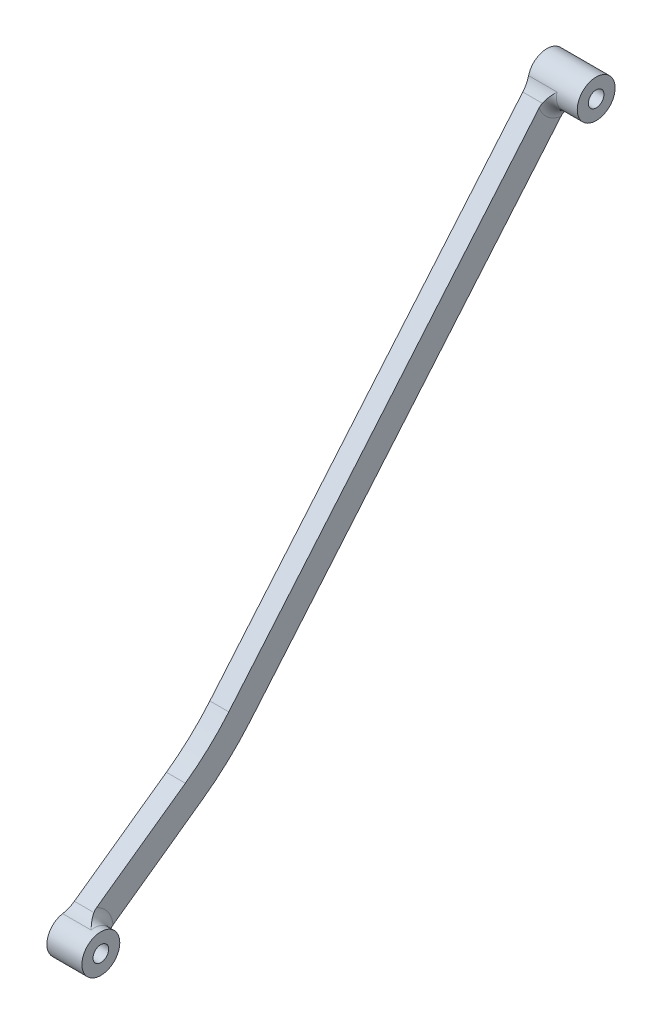
ISO-10303-21;
HEADER;
FILE_DESCRIPTION(('STEP AP214'),'2;1');
FILE_NAME('part.step','',(''),(''),'','','');
FILE_SCHEMA(('AUTOMOTIVE_DESIGN { 1 0 10303 214 1 1 1 1 }'));
ENDSEC;
DATA;
#1=APPLICATION_CONTEXT('core data for automotive mechanical design processes');
#2=APPLICATION_PROTOCOL_DEFINITION('international standard','automotive_design',2000,#1);
#3=PRODUCT_CONTEXT('',#1,'mechanical');
#4=PRODUCT('Part','Part','',(#3));
#5=PRODUCT_RELATED_PRODUCT_CATEGORY('part','',(#4));
#6=PRODUCT_DEFINITION_FORMATION('','',#4);
#7=PRODUCT_DEFINITION_CONTEXT('part definition',#1,'design');
#8=PRODUCT_DEFINITION('design','',#6,#7);
#9=PRODUCT_DEFINITION_SHAPE('','',#8);
#10=(LENGTH_UNIT() NAMED_UNIT(*) SI_UNIT(.MILLI.,.METRE.));
#11=(NAMED_UNIT(*) PLANE_ANGLE_UNIT() SI_UNIT($,.RADIAN.));
#12=(NAMED_UNIT(*) SI_UNIT($,.STERADIAN.) SOLID_ANGLE_UNIT());
#13=UNCERTAINTY_MEASURE_WITH_UNIT(LENGTH_MEASURE(1.E-05),#10,'distance_accuracy_value','');
#14=(GEOMETRIC_REPRESENTATION_CONTEXT(3) GLOBAL_UNCERTAINTY_ASSIGNED_CONTEXT((#13)) GLOBAL_UNIT_ASSIGNED_CONTEXT((#10,
#11,#12)) REPRESENTATION_CONTEXT('',''));
#15=CARTESIAN_POINT('',(0.,0.,0.));
#16=DIRECTION('',(0.,0.,1.));
#17=DIRECTION('',(1.,0.,0.));
#18=AXIS2_PLACEMENT_3D('',#15,#16,#17);
#19=CARTESIAN_POINT('',(-10.4,5.25197985592545,2.92050431510645));
#20=DIRECTION('',(1.,0.,0.));
#21=DIRECTION('',(0.,0.,-1.));
#22=AXIS2_PLACEMENT_3D('',#19,#20,#21);
#23=PLANE('',#22);
#24=DIRECTION('',(0.,0.764317499891993,-0.644840103714753));
#25=VECTOR('',#24,1.);
#26=CARTESIAN_POINT('',(-10.4,48.8034109855133,-107.090988786139));
#27=LINE('',#26,#25);
#28=CARTESIAN_POINT('',(-10.4,-30.8590659521007,-39.8812756788452));
#29=VERTEX_POINT('',#28);
#30=CARTESIAN_POINT('',(-10.4,46.8540947841413,-105.446387868794));
#31=VERTEX_POINT('',#30);
#32=EDGE_CURVE('E152',#29,#31,#27,.T.);
#33=ORIENTED_EDGE('',*,*,#32,.T.);
#34=CARTESIAN_POINT('',(-10.4,52.7601253240664,-106.504122836293));
#35=DIRECTION('',(1.,0.,0.));
#36=DIRECTION('',(0.,0.,-1.));
#37=AXIS2_PLACEMENT_3D('',#34,#35,#36);
#38=CIRCLE('',#37,6.);
#39=CARTESIAN_POINT('',(-10.4,50.7231354064298,-100.860482869442));
#40=VERTEX_POINT('',#39);
#41=EDGE_CURVE('E213',#31,#40,#38,.F.);
#42=ORIENTED_EDGE('',*,*,#41,.T.);
#43=DIRECTION('',(0.,-0.764317499891994,0.644840103714753));
#44=VECTOR('',#43,1.);
#45=CARTESIAN_POINT('',(-10.4,-26.9900253298122,-35.2953706794932));
#46=LINE('',#45,#44);
#47=CARTESIAN_POINT('',(-10.4,-26.9900253298122,-35.2953706794932));
#48=VERTEX_POINT('',#47);
#49=EDGE_CURVE('E150',#40,#48,#46,.T.);
#50=ORIENTED_EDGE('',*,*,#49,.T.);
#51=CARTESIAN_POINT('',(-10.4,5.25197985592545,2.92050431510645));
#52=DIRECTION('',(-1.,0.,0.));
#53=DIRECTION('',(0.,0.,-1.));
#54=AXIS2_PLACEMENT_3D('',#51,#52,#53);
#55=CIRCLE('',#54,50.);
#56=CARTESIAN_POINT('',(-10.4,-35.4512440227599,-26.1182209647955));
#57=VERTEX_POINT('',#56);
#58=EDGE_CURVE('E172',#48,#57,#55,.T.);
#59=ORIENTED_EDGE('',*,*,#58,.T.);
#60=DIRECTION('',(0.,-0.580774505598039,0.814064477573708));
#61=VECTOR('',#60,1.);
#62=CARTESIAN_POINT('',(-10.4,-50.3176539374741,-5.28015713112846));
#63=LINE('',#62,#61);
#64=CARTESIAN_POINT('',(-10.4,-48.8364459927835,-7.35634807968074));
#65=VERTEX_POINT('',#64);
#66=EDGE_CURVE('E128',#57,#65,#63,.T.);
#67=ORIENTED_EDGE('',*,*,#66,.T.);
#68=CARTESIAN_POINT('',(-10.4,-54.2964322798141,-4.86866848909084));
#69=DIRECTION('',(1.,0.,0.));
#70=DIRECTION('',(0.,0.,-1.));
#71=AXIS2_PLACEMENT_3D('',#68,#69,#70);
#72=CIRCLE('',#71,6.);
#73=CARTESIAN_POINT('',(-10.4,-53.7208328582257,-10.840995113269));
#74=VERTEX_POINT('',#73);
#75=EDGE_CURVE('E211',#65,#74,#72,.F.);
#76=ORIENTED_EDGE('',*,*,#75,.T.);
#77=DIRECTION('',(0.,0.58077450559804,-0.814064477573707));
#78=VECTOR('',#77,1.);
#79=CARTESIAN_POINT('',(-10.4,-55.2020408029163,-8.76480416471669));
#80=LINE('',#79,#78);
#81=CARTESIAN_POINT('',(-10.4,-40.3356308882021,-29.6028679983837));
#82=VERTEX_POINT('',#81);
#83=EDGE_CURVE('E175',#74,#82,#80,.T.);
#84=ORIENTED_EDGE('',*,*,#83,.T.);
#85=CARTESIAN_POINT('',(-10.4,5.25197985592545,2.92050431510645));
#86=DIRECTION('',(1.,0.,0.));
#87=DIRECTION('',(0.,0.,-1.));
#88=AXIS2_PLACEMENT_3D('',#85,#86,#87);
#89=CIRCLE('',#88,56.);
#90=EDGE_CURVE('E177',#82,#29,#89,.T.);
#91=ORIENTED_EDGE('',*,*,#90,.T.);
#92=EDGE_LOOP('',(#33,#42,#50,#59,#67,#76,#84,#91));
#93=FACE_BOUND('',#92,.T.);
#94=ADVANCED_FACE('F17',(#93),#23,.T.);
#95=CARTESIAN_POINT('',(-14.4,5.25197985592545,2.92050431510645));
#96=DIRECTION('',(1.,0.,0.));
#97=DIRECTION('',(0.,0.,-1.));
#98=AXIS2_PLACEMENT_3D('',#95,#96,#97);
#99=CYLINDRICAL_SURFACE('',#98,50.);
#100=ORIENTED_EDGE('',*,*,#58,.F.);
#101=DIRECTION('',(1.,0.,0.));
#102=VECTOR('',#101,1.);
#103=CARTESIAN_POINT('',(-14.4,-26.9900253298122,-35.2953706794932));
#104=LINE('',#103,#102);
#105=CARTESIAN_POINT('',(-14.4,-26.9900253298122,-35.2953706794932));
#106=VERTEX_POINT('',#105);
#107=EDGE_CURVE('E149',#106,#48,#104,.T.);
#108=ORIENTED_EDGE('',*,*,#107,.F.);
#109=CARTESIAN_POINT('',(-14.4,5.25197985592545,2.92050431510645));
#110=DIRECTION('',(-1.,0.,0.));
#111=DIRECTION('',(0.,0.,-1.));
#112=AXIS2_PLACEMENT_3D('',#109,#110,#111);
#113=CIRCLE('',#112,50.);
#114=CARTESIAN_POINT('',(-14.4,-35.4512440227599,-26.1182209647955));
#115=VERTEX_POINT('',#114);
#116=EDGE_CURVE('E140',#106,#115,#113,.T.);
#117=ORIENTED_EDGE('',*,*,#116,.T.);
#118=DIRECTION('',(1.,0.,0.));
#119=VECTOR('',#118,1.);
#120=CARTESIAN_POINT('',(-14.4,-35.4512440227599,-26.1182209647955));
#121=LINE('',#120,#119);
#122=EDGE_CURVE('E123',#115,#57,#121,.T.);
#123=ORIENTED_EDGE('',*,*,#122,.T.);
#124=EDGE_LOOP('',(#100,#108,#117,#123));
#125=FACE_BOUND('',#124,.T.);
#126=ADVANCED_FACE('F147',(#125),#99,.F.);
#127=CARTESIAN_POINT('',(-14.4,-26.9900253298122,-35.2953706794932));
#128=DIRECTION('',(0.,0.644840103714753,0.764317499891994));
#129=DIRECTION('',(0.,-0.764317499891993,0.644840103714752));
#130=AXIS2_PLACEMENT_3D('',#127,#128,#129);
#131=PLANE('',#130);
#132=ORIENTED_EDGE('',*,*,#49,.F.);
#133=CARTESIAN_POINT('',(-10.4,50.7231354064298,-100.860482869442));
#134=CARTESIAN_POINT('',(-10.4000018780008,50.7774750690846,-100.906328206893));
#135=CARTESIAN_POINT('',(-10.3971571203398,50.8318042633384,-100.952164712353));
#136=CARTESIAN_POINT('',(-10.3859981831861,50.9398251784934,-101.043299899159));
#137=CARTESIAN_POINT('',(-10.3777150882286,50.993518767172,-101.088600156313));
#138=CARTESIAN_POINT('',(-10.3559028720338,51.1002549971292,-101.178651478709));
#139=CARTESIAN_POINT('',(-10.3423756939953,51.153297872028,-101.223402741052));
#140=CARTESIAN_POINT('',(-10.3101728421491,51.2587825025997,-101.312398112907));
#141=CARTESIAN_POINT('',(-10.2914682778259,51.3112191124919,-101.356637881022));
#142=CARTESIAN_POINT('',(-10.2703025064278,51.3630628924018,-101.400377489783));
#143=B_SPLINE_CURVE_WITH_KNOTS('',3,(#133,#134,#135,#136,#137,#138,#139,#140,#141,#142),
.UNSPECIFIED.,.F.,.F.,(4,2,2,2,4),(0.,0.213210416869426,0.425212649260023,0.637136399038002,
0.850267417765427),.UNSPECIFIED.);
#144=CARTESIAN_POINT('',(-10.270302506428,51.3630628924018,-101.400377489783));
#145=VERTEX_POINT('',#144);
#146=EDGE_CURVE('E256',#40,#145,#143,.T.);
#147=ORIENTED_EDGE('',*,*,#146,.T.);
#148=DIRECTION('',(-1.,0.,0.));
#149=VECTOR('',#148,1.);
#150=CARTESIAN_POINT('',(-14.4,51.3630628924018,-101.400377489783));
#151=LINE('',#150,#149);
#152=CARTESIAN_POINT('',(-14.4,51.3630628924018,-101.400377489783));
#153=VERTEX_POINT('',#152);
#154=EDGE_CURVE('E199',#145,#153,#151,.T.);
#155=ORIENTED_EDGE('',*,*,#154,.T.);
#156=DIRECTION('',(0.,-0.764317499891994,0.644840103714753));
#157=VECTOR('',#156,1.);
#158=CARTESIAN_POINT('',(-14.4,-26.9900253298122,-35.2953706794932));
#159=LINE('',#158,#157);
#160=EDGE_CURVE('E134',#153,#106,#159,.T.);
#161=ORIENTED_EDGE('',*,*,#160,.T.);
#162=ORIENTED_EDGE('',*,*,#107,.T.);
#163=EDGE_LOOP('',(#132,#147,#155,#161,#162));
#164=FACE_BOUND('',#163,.T.);
#165=ADVANCED_FACE('F284',(#164),#131,.T.);
#166=CARTESIAN_POINT('',(-14.4,52.7601253240664,-106.504122836293));
#167=DIRECTION('',(1.,0.,0.));
#168=DIRECTION('',(0.,0.,-1.));
#169=AXIS2_PLACEMENT_3D('',#166,#167,#168);
#170=CYLINDRICAL_SURFACE('',#169,4.);
#171=CARTESIAN_POINT('',(-8.4,52.7601253240664,-106.504122836293));
#172=DIRECTION('',(1.,0.,0.));
#173=DIRECTION('',(0.,0.,-1.));
#174=AXIS2_PLACEMENT_3D('',#171,#172,#173);
#175=CIRCLE('',#174,4.);
#176=CARTESIAN_POINT('',(-8.4,53.748916600316,-102.628262697948));
#177=VERTEX_POINT('',#176);
#178=CARTESIAN_POINT('',(-8.4,49.1060678535697,-108.131348697171));
#179=VERTEX_POINT('',#178);
#180=EDGE_CURVE('E208',#177,#179,#175,.T.);
#181=ORIENTED_EDGE('',*,*,#180,.T.);
#182=DIRECTION('',(1.,0.,0.));
#183=VECTOR('',#182,1.);
#184=CARTESIAN_POINT('',(-14.4,49.1060678535697,-108.131348697171));
#185=LINE('',#184,#183);
#186=CARTESIAN_POINT('',(-14.4,49.1060678535697,-108.131348697171));
#187=VERTEX_POINT('',#186);
#188=EDGE_CURVE('E197',#179,#187,#185,.F.);
#189=ORIENTED_EDGE('',*,*,#188,.T.);
#190=CARTESIAN_POINT('',(-14.4,52.7601253240664,-106.504122836293));
#191=DIRECTION('',(1.,0.,0.));
#192=DIRECTION('',(0.,0.,1.));
#193=AXIS2_PLACEMENT_3D('',#190,#191,#192);
#194=CIRCLE('',#193,4.);
#195=CARTESIAN_POINT('',(-14.4,53.748916600316,-102.628262697948));
#196=VERTEX_POINT('',#195);
#197=EDGE_CURVE('E168',#187,#196,#194,.T.);
#198=ORIENTED_EDGE('',*,*,#197,.T.);
#199=DIRECTION('',(1.,0.,0.));
#200=VECTOR('',#199,1.);
#201=CARTESIAN_POINT('',(-14.4,53.748916600316,-102.628262697948));
#202=LINE('',#201,#200);
#203=EDGE_CURVE('E195',#196,#177,#202,.T.);
#204=ORIENTED_EDGE('',*,*,#203,.T.);
#205=EDGE_LOOP('',(#181,#189,#198,#204));
#206=FACE_BOUND('',#205,.T.);
#207=CARTESIAN_POINT('',(-4.,52.7601253240664,-106.504122836293));
#208=DIRECTION('',(-1.,0.,0.));
#209=DIRECTION('',(0.,0.,1.));
#210=AXIS2_PLACEMENT_3D('',#207,#208,#209);
#211=CIRCLE('',#210,4.);
#212=CARTESIAN_POINT('',(-4.,52.7601253240664,-102.504122836293));
#213=VERTEX_POINT('',#212);
#214=EDGE_CURVE('E434',#213,#213,#211,.T.);
#215=ORIENTED_EDGE('',*,*,#214,.T.);
#216=EDGE_LOOP('',(#215));
#217=FACE_BOUND('',#216,.T.);
#218=ADVANCED_FACE('F310',(#206,#217),#170,.T.);
#219=CARTESIAN_POINT('',(-14.4,48.8034109855133,-107.090988786139));
#220=DIRECTION('',(0.,-0.644840103714753,-0.764317499891993));
#221=DIRECTION('',(0.,0.764317499891993,-0.644840103714753));
#222=AXIS2_PLACEMENT_3D('',#219,#220,#221);
#223=PLANE('',#222);
#224=DIRECTION('',(0.,0.764317499891993,-0.644840103714753));
#225=VECTOR('',#224,1.);
#226=CARTESIAN_POINT('',(-14.4,48.8034109855133,-107.090988786139));
#227=LINE('',#226,#225);
#228=CARTESIAN_POINT('',(-14.4,-30.8590659521007,-39.8812756788452));
#229=VERTEX_POINT('',#228);
#230=CARTESIAN_POINT('',(-14.4,47.4940222701133,-105.986282489135));
#231=VERTEX_POINT('',#230);
#232=EDGE_CURVE('E165',#229,#231,#227,.T.);
#233=ORIENTED_EDGE('',*,*,#232,.T.);
#234=DIRECTION('',(-1.,0.,0.));
#235=VECTOR('',#234,1.);
#236=CARTESIAN_POINT('',(-10.4,47.4940222701133,-105.986282489135));
#237=LINE('',#236,#235);
#238=CARTESIAN_POINT('',(-10.270302506428,47.4940222701133,-105.986282489135));
#239=VERTEX_POINT('',#238);
#240=EDGE_CURVE('E193',#231,#239,#237,.F.);
#241=ORIENTED_EDGE('',*,*,#240,.T.);
#242=CARTESIAN_POINT('',(-10.270302506428,47.4940222701133,-105.986282489135));
#243=CARTESIAN_POINT('',(-10.291468277826,47.4421784902035,-105.942542880374));
#244=CARTESIAN_POINT('',(-10.3101728421492,47.3897418803113,-105.898303112259));
#245=CARTESIAN_POINT('',(-10.3423756939953,47.2842572497396,-105.809307740404));
#246=CARTESIAN_POINT('',(-10.3559028720338,47.2312143748408,-105.764556478061));
#247=CARTESIAN_POINT('',(-10.3777150882286,47.1244781448836,-105.674505155665));
#248=CARTESIAN_POINT('',(-10.3859981831861,47.070784556205,-105.629204898511));
#249=CARTESIAN_POINT('',(-10.3971571203398,46.96276364105,-105.538069711705));
#250=CARTESIAN_POINT('',(-10.4000018780008,46.9084344467962,-105.492233206244));
#251=CARTESIAN_POINT('',(-10.4,46.8540947841413,-105.446387868794));
#252=B_SPLINE_CURVE_WITH_KNOTS('',3,(#242,#243,#244,#245,#246,#247,#248,#249,#250,#251),
.UNSPECIFIED.,.F.,.F.,(4,2,2,2,4),(0.,0.213131018727409,0.425054768505373,0.637057000895975,
0.850267417765393),.UNSPECIFIED.);
#253=EDGE_CURVE('E226',#239,#31,#252,.T.);
#254=ORIENTED_EDGE('',*,*,#253,.T.);
#255=ORIENTED_EDGE('',*,*,#32,.F.);
#256=DIRECTION('',(1.,0.,0.));
#257=VECTOR('',#256,1.);
#258=CARTESIAN_POINT('',(-14.4,-30.8590659521007,-39.8812756788452));
#259=LINE('',#258,#257);
#260=EDGE_CURVE('E184',#229,#29,#259,.T.);
#261=ORIENTED_EDGE('',*,*,#260,.F.);
#262=EDGE_LOOP('',(#233,#241,#254,#255,#261));
#263=FACE_BOUND('',#262,.T.);
#264=ADVANCED_FACE('F313',(#263),#223,.T.);
#265=CARTESIAN_POINT('',(-14.4,5.25197985592545,2.92050431510645));
#266=DIRECTION('',(1.,0.,0.));
#267=DIRECTION('',(0.,0.,-1.));
#268=AXIS2_PLACEMENT_3D('',#265,#266,#267);
#269=CYLINDRICAL_SURFACE('',#268,56.);
#270=ORIENTED_EDGE('',*,*,#90,.F.);
#271=DIRECTION('',(1.,0.,0.));
#272=VECTOR('',#271,1.);
#273=CARTESIAN_POINT('',(-14.4,-40.3356308882021,-29.6028679983837));
#274=LINE('',#273,#272);
#275=CARTESIAN_POINT('',(-14.4,-40.3356308882021,-29.6028679983837));
#276=VERTEX_POINT('',#275);
#277=EDGE_CURVE('E133',#276,#82,#274,.T.);
#278=ORIENTED_EDGE('',*,*,#277,.F.);
#279=CARTESIAN_POINT('',(-14.4,5.25197985592545,2.92050431510645));
#280=DIRECTION('',(1.,0.,0.));
#281=DIRECTION('',(0.,0.,-1.));
#282=AXIS2_PLACEMENT_3D('',#279,#280,#281);
#283=CIRCLE('',#282,56.);
#284=EDGE_CURVE('E162',#276,#229,#283,.T.);
#285=ORIENTED_EDGE('',*,*,#284,.T.);
#286=ORIENTED_EDGE('',*,*,#260,.T.);
#287=EDGE_LOOP('',(#270,#278,#285,#286));
#288=FACE_BOUND('',#287,.T.);
#289=ADVANCED_FACE('F318',(#288),#269,.T.);
#290=CARTESIAN_POINT('',(-14.4,-55.2020408029163,-8.76480416471669));
#291=DIRECTION('',(0.,-0.814064477573707,-0.58077450559804));
#292=DIRECTION('',(0.,0.58077450559804,-0.814064477573707));
#293=AXIS2_PLACEMENT_3D('',#290,#291,#292);
#294=PLANE('',#293);
#295=ORIENTED_EDGE('',*,*,#83,.F.);
#296=CARTESIAN_POINT('',(-10.4,-53.7208328582257,-10.840995113269));
#297=CARTESIAN_POINT('',(-10.4000018780008,-53.76212340923,-10.7831186560415));
#298=CARTESIAN_POINT('',(-10.3971571203399,-53.8034060057121,-10.7252533485699));
#299=CARTESIAN_POINT('',(-10.3859981831861,-53.8854868079995,-10.6102016980776));
#300=CARTESIAN_POINT('',(-10.3777150882286,-53.9262864330545,-10.553013365712));
#301=CARTESIAN_POINT('',(-10.3559028720338,-54.0073910540942,-10.4393300164618));
#302=CARTESIAN_POINT('',(-10.3423756939953,-54.0476962275977,-10.3828347507514));
#303=CARTESIAN_POINT('',(-10.3101728421491,-54.1278498079843,-10.2704844634813));
#304=CARTESIAN_POINT('',(-10.2914682778259,-54.1676943047931,-10.2146349226247));
#305=CARTESIAN_POINT('',(-10.2703025064278,-54.2070883336486,-10.159416797155));
#306=B_SPLINE_CURVE_WITH_KNOTS('',3,(#296,#297,#298,#299,#300,#301,#302,#303,#304,#305),
.UNSPECIFIED.,.F.,.F.,(4,2,2,2,4),(0.,0.213210416869423,0.42521264926002,0.637136399037985,
0.850267417765413),.UNSPECIFIED.);
#307=CARTESIAN_POINT('',(-10.270302506428,-54.2070883336486,-10.159416797155));
#308=VERTEX_POINT('',#307);
#309=EDGE_CURVE('E31',#74,#308,#306,.T.);
#310=ORIENTED_EDGE('',*,*,#309,.T.);
#311=DIRECTION('',(-1.,0.,0.));
#312=VECTOR('',#311,1.);
#313=CARTESIAN_POINT('',(-14.4,-54.2070883336486,-10.159416797155));
#314=LINE('',#313,#312);
#315=CARTESIAN_POINT('',(-14.4,-54.2070883336486,-10.159416797155));
#316=VERTEX_POINT('',#315);
#317=EDGE_CURVE('E37',#308,#316,#314,.T.);
#318=ORIENTED_EDGE('',*,*,#317,.T.);
#319=DIRECTION('',(0.,0.58077450559804,-0.814064477573707));
#320=VECTOR('',#319,1.);
#321=CARTESIAN_POINT('',(-14.4,-55.2020408029163,-8.76480416471669));
#322=LINE('',#321,#320);
#323=EDGE_CURVE('E160',#316,#276,#322,.T.);
#324=ORIENTED_EDGE('',*,*,#323,.T.);
#325=ORIENTED_EDGE('',*,*,#277,.T.);
#326=EDGE_LOOP('',(#295,#310,#318,#324,#325));
#327=FACE_BOUND('',#326,.T.);
#328=ADVANCED_FACE('F321',(#327),#294,.T.);
#329=CARTESIAN_POINT('',(-14.4,-54.2964322798141,-4.86866848909084));
#330=DIRECTION('',(1.,0.,0.));
#331=DIRECTION('',(0.,0.,-1.));
#332=AXIS2_PLACEMENT_3D('',#329,#330,#331);
#333=CYLINDRICAL_SURFACE('',#332,4.);
#334=CARTESIAN_POINT('',(-8.4,-54.2964322798141,-4.86866848909084));
#335=DIRECTION('',(1.,0.,0.));
#336=DIRECTION('',(0.,0.,-1.));
#337=AXIS2_PLACEMENT_3D('',#334,#335,#336);
#338=CIRCLE('',#337,4.);
#339=CARTESIAN_POINT('',(-8.4,-56.2144494475248,-8.37882662575179));
#340=VERTEX_POINT('',#339);
#341=CARTESIAN_POINT('',(-8.4,-50.3531852089941,-4.19725018544589));
#342=VERTEX_POINT('',#341);
#343=EDGE_CURVE('E215',#340,#342,#338,.T.);
#344=ORIENTED_EDGE('',*,*,#343,.T.);
#345=DIRECTION('',(1.,0.,0.));
#346=VECTOR('',#345,1.);
#347=CARTESIAN_POINT('',(-14.4,-50.3531852089941,-4.19725018544589));
#348=LINE('',#347,#346);
#349=CARTESIAN_POINT('',(-14.4,-50.3531852089941,-4.19725018544589));
#350=VERTEX_POINT('',#349);
#351=EDGE_CURVE('E183',#342,#350,#348,.F.);
#352=ORIENTED_EDGE('',*,*,#351,.T.);
#353=CARTESIAN_POINT('',(-14.4,-54.2964322798141,-4.86866848909084));
#354=DIRECTION('',(1.,0.,0.));
#355=DIRECTION('',(0.,0.,-1.));
#356=AXIS2_PLACEMENT_3D('',#353,#354,#355);
#357=CIRCLE('',#356,4.);
#358=CARTESIAN_POINT('',(-14.4,-56.2144494475248,-8.37882662575179));
#359=VERTEX_POINT('',#358);
#360=EDGE_CURVE('E144',#350,#359,#357,.T.);
#361=ORIENTED_EDGE('',*,*,#360,.T.);
#362=DIRECTION('',(1.,0.,0.));
#363=VECTOR('',#362,1.);
#364=CARTESIAN_POINT('',(-14.4,-56.2144494475248,-8.37882662575179));
#365=LINE('',#364,#363);
#366=EDGE_CURVE('E189',#359,#340,#365,.T.);
#367=ORIENTED_EDGE('',*,*,#366,.T.);
#368=EDGE_LOOP('',(#344,#352,#361,#367));
#369=FACE_BOUND('',#368,.T.);
#370=CARTESIAN_POINT('',(-7.,-54.2964322798141,-4.86866848909084));
#371=DIRECTION('',(1.,0.,0.));
#372=DIRECTION('',(0.,0.,-1.));
#373=AXIS2_PLACEMENT_3D('',#370,#371,#372);
#374=CIRCLE('',#373,4.);
#375=CARTESIAN_POINT('',(-7.,-54.2964322798141,-8.86866848909084));
#376=VERTEX_POINT('',#375);
#377=EDGE_CURVE('E427',#376,#376,#374,.T.);
#378=ORIENTED_EDGE('',*,*,#377,.F.);
#379=EDGE_LOOP('',(#378));
#380=FACE_BOUND('',#379,.T.);
#381=ADVANCED_FACE('F282',(#369,#380),#333,.T.);
#382=CARTESIAN_POINT('',(-14.4,-50.3176539374741,-5.28015713112846));
#383=DIRECTION('',(0.,0.814064477573708,0.580774505598039));
#384=DIRECTION('',(0.,-0.580774505598039,0.814064477573708));
#385=AXIS2_PLACEMENT_3D('',#382,#383,#384);
#386=PLANE('',#385);
#387=DIRECTION('',(0.,-0.580774505598039,0.814064477573708));
#388=VECTOR('',#387,1.);
#389=CARTESIAN_POINT('',(-14.4,-50.3176539374741,-5.28015713112846));
#390=LINE('',#389,#388);
#391=CARTESIAN_POINT('',(-14.4,-49.3227014682063,-6.67476976356672));
#392=VERTEX_POINT('',#391);
#393=EDGE_CURVE('E126',#115,#392,#390,.T.);
#394=ORIENTED_EDGE('',*,*,#393,.T.);
#395=DIRECTION('',(-1.,0.,0.));
#396=VECTOR('',#395,1.);
#397=CARTESIAN_POINT('',(-10.4,-49.3227014682063,-6.67476976356672));
#398=LINE('',#397,#396);
#399=CARTESIAN_POINT('',(-10.270302506428,-49.3227014682063,-6.67476976356672));
#400=VERTEX_POINT('',#399);
#401=EDGE_CURVE('E45',#392,#400,#398,.F.);
#402=ORIENTED_EDGE('',*,*,#401,.T.);
#403=CARTESIAN_POINT('',(-10.270302506428,-49.3227014682063,-6.67476976356672));
#404=CARTESIAN_POINT('',(-10.291468277826,-49.2833074393509,-6.72998788903648));
#405=CARTESIAN_POINT('',(-10.3101728421492,-49.243462942542,-6.78583742989312));
#406=CARTESIAN_POINT('',(-10.3423756939953,-49.1633093621555,-6.89818771716319));
#407=CARTESIAN_POINT('',(-10.3559028720338,-49.123004188652,-6.9546829828736));
#408=CARTESIAN_POINT('',(-10.3777150882286,-49.0418995676123,-7.06836633212375));
#409=CARTESIAN_POINT('',(-10.3859981831861,-49.0010999425573,-7.12555466448944));
#410=CARTESIAN_POINT('',(-10.3971571203398,-48.9190191402699,-7.2406063149817));
#411=CARTESIAN_POINT('',(-10.4000018780008,-48.8777365437878,-7.29847162245332));
#412=CARTESIAN_POINT('',(-10.4,-48.8364459927835,-7.35634807968074));
#413=B_SPLINE_CURVE_WITH_KNOTS('',3,(#403,#404,#405,#406,#407,#408,#409,#410,#411,#412),
.UNSPECIFIED.,.F.,.F.,(4,2,2,2,4),(0.,0.213131018727391,0.42505476850534,0.637057000895925,
0.85026741776532),.UNSPECIFIED.);
#414=EDGE_CURVE('E267',#400,#65,#413,.T.);
#415=ORIENTED_EDGE('',*,*,#414,.T.);
#416=ORIENTED_EDGE('',*,*,#66,.F.);
#417=ORIENTED_EDGE('',*,*,#122,.F.);
#418=EDGE_LOOP('',(#394,#402,#415,#416,#417));
#419=FACE_BOUND('',#418,.T.);
#420=ADVANCED_FACE('F125',(#419),#386,.T.);
#421=CARTESIAN_POINT('',(-14.4,5.25197985592545,2.92050431510645));
#422=DIRECTION('',(1.,0.,0.));
#423=DIRECTION('',(0.,0.,-1.));
#424=AXIS2_PLACEMENT_3D('',#421,#422,#423);
#425=PLANE('',#424);
#426=CARTESIAN_POINT('',(-14.4,52.7601253240664,-106.504122836293));
#427=DIRECTION('',(1.,0.,0.));
#428=DIRECTION('',(0.,0.,-1.));
#429=AXIS2_PLACEMENT_3D('',#426,#427,#428);
#430=CIRCLE('',#429,1.65);
#431=CARTESIAN_POINT('',(-14.4,52.7601253240664,-108.154122836293));
#432=VERTEX_POINT('',#431);
#433=EDGE_CURVE('E431',#432,#432,#430,.T.);
#434=ORIENTED_EDGE('',*,*,#433,.T.);
#435=EDGE_LOOP('',(#434));
#436=FACE_BOUND('',#435,.T.);
#437=CARTESIAN_POINT('',(-14.4,-54.2964322798141,-4.86866848909084));
#438=DIRECTION('',(1.,0.,0.));
#439=DIRECTION('',(0.,0.,-1.));
#440=AXIS2_PLACEMENT_3D('',#437,#438,#439);
#441=CIRCLE('',#440,1.65);
#442=CARTESIAN_POINT('',(-14.4,-54.2964322798141,-6.51866848909084));
#443=VERTEX_POINT('',#442);
#444=EDGE_CURVE('E155',#443,#443,#441,.T.);
#445=ORIENTED_EDGE('',*,*,#444,.T.);
#446=EDGE_LOOP('',(#445));
#447=FACE_BOUND('',#446,.T.);
#448=ORIENTED_EDGE('',*,*,#116,.F.);
#449=ORIENTED_EDGE('',*,*,#160,.F.);
#450=CARTESIAN_POINT('',(-14.4,55.2321035146903,-96.8144724904307));
#451=DIRECTION('',(1.,0.,0.));
#452=DIRECTION('',(0.,0.,-1.));
#453=AXIS2_PLACEMENT_3D('',#450,#451,#452);
#454=CIRCLE('',#453,6.);
#455=EDGE_CURVE('E206',#153,#196,#454,.T.);
#456=ORIENTED_EDGE('',*,*,#455,.T.);
#457=ORIENTED_EDGE('',*,*,#197,.F.);
#458=CARTESIAN_POINT('',(-14.4,43.6249816478248,-110.572187488487));
#459=DIRECTION('',(1.,0.,0.));
#460=DIRECTION('',(0.,0.,-1.));
#461=AXIS2_PLACEMENT_3D('',#458,#459,#460);
#462=CIRCLE('',#461,6.);
#463=EDGE_CURVE('E204',#187,#231,#462,.T.);
#464=ORIENTED_EDGE('',*,*,#463,.T.);
#465=ORIENTED_EDGE('',*,*,#232,.F.);
#466=ORIENTED_EDGE('',*,*,#284,.F.);
#467=ORIENTED_EDGE('',*,*,#323,.F.);
#468=CARTESIAN_POINT('',(-14.4,-59.0914751990908,-13.6440638307432));
#469=DIRECTION('',(1.,0.,0.));
#470=DIRECTION('',(0.,0.,-1.));
#471=AXIS2_PLACEMENT_3D('',#468,#469,#470);
#472=CIRCLE('',#471,6.);
#473=EDGE_CURVE('E201',#316,#359,#472,.T.);
#474=ORIENTED_EDGE('',*,*,#473,.T.);
#475=ORIENTED_EDGE('',*,*,#360,.F.);
#476=CARTESIAN_POINT('',(-14.4,-44.4383146027641,-3.19012272997848));
#477=DIRECTION('',(1.,0.,0.));
#478=DIRECTION('',(0.,0.,-1.));
#479=AXIS2_PLACEMENT_3D('',#476,#477,#478);
#480=CIRCLE('',#479,6.);
#481=EDGE_CURVE('E143',#350,#392,#480,.T.);
#482=ORIENTED_EDGE('',*,*,#481,.T.);
#483=ORIENTED_EDGE('',*,*,#393,.F.);
#484=EDGE_LOOP('',(#448,#449,#456,#457,#464,#465,#466,#467,#474,#475,#482,#483));
#485=FACE_BOUND('',#484,.T.);
#486=ADVANCED_FACE('F138',(#436,#447,#485),#425,.F.);
#487=CARTESIAN_POINT('',(-14.4,-54.2964322798141,-4.86866848909084));
#488=DIRECTION('',(1.,0.,0.));
#489=DIRECTION('',(0.,0.,-1.));
#490=AXIS2_PLACEMENT_3D('',#487,#488,#489);
#491=CYLINDRICAL_SURFACE('',#490,1.65);
#492=ORIENTED_EDGE('',*,*,#444,.F.);
#493=EDGE_LOOP('',(#492));
#494=FACE_BOUND('',#493,.T.);
#495=CARTESIAN_POINT('',(-7.,-54.2964322798141,-4.86866848909084));
#496=DIRECTION('',(1.,0.,0.));
#497=DIRECTION('',(0.,0.,-1.));
#498=AXIS2_PLACEMENT_3D('',#495,#496,#497);
#499=CIRCLE('',#498,1.65);
#500=CARTESIAN_POINT('',(-7.,-54.2964322798141,-6.51866848909084));
#501=VERTEX_POINT('',#500);
#502=EDGE_CURVE('E426',#501,#501,#499,.T.);
#503=ORIENTED_EDGE('',*,*,#502,.T.);
#504=EDGE_LOOP('',(#503));
#505=FACE_BOUND('',#504,.T.);
#506=ADVANCED_FACE('F387',(#494,#505),#491,.F.);
#507=CARTESIAN_POINT('',(-14.4,52.7601253240664,-106.504122836293));
#508=DIRECTION('',(1.,0.,0.));
#509=DIRECTION('',(0.,0.,-1.));
#510=AXIS2_PLACEMENT_3D('',#507,#508,#509);
#511=CYLINDRICAL_SURFACE('',#510,1.65);
#512=ORIENTED_EDGE('',*,*,#433,.F.);
#513=EDGE_LOOP('',(#512));
#514=FACE_BOUND('',#513,.T.);
#515=CARTESIAN_POINT('',(-4.,52.7601253240664,-106.504122836293));
#516=DIRECTION('',(1.,0.,0.));
#517=DIRECTION('',(0.,0.,-1.));
#518=AXIS2_PLACEMENT_3D('',#515,#516,#517);
#519=CIRCLE('',#518,1.65);
#520=CARTESIAN_POINT('',(-4.,52.7601253240664,-108.154122836293));
#521=VERTEX_POINT('',#520);
#522=EDGE_CURVE('E428',#521,#521,#519,.T.);
#523=ORIENTED_EDGE('',*,*,#522,.T.);
#524=EDGE_LOOP('',(#523));
#525=FACE_BOUND('',#524,.T.);
#526=ADVANCED_FACE('F395',(#514,#525),#511,.F.);
#527=CARTESIAN_POINT('',(-7.,-43.,5.));
#528=DIRECTION('',(1.,0.,0.));
#529=DIRECTION('',(0.,0.,-1.));
#530=AXIS2_PLACEMENT_3D('',#527,#528,#529);
#531=PLANE('',#530);
#532=ORIENTED_EDGE('',*,*,#502,.F.);
#533=EDGE_LOOP('',(#532));
#534=FACE_BOUND('',#533,.T.);
#535=ORIENTED_EDGE('',*,*,#377,.T.);
#536=EDGE_LOOP('',(#535));
#537=FACE_BOUND('',#536,.T.);
#538=ADVANCED_FACE('F296',(#534,#537),#531,.T.);
#539=CARTESIAN_POINT('',(-4.,-32.7106781186548,-105.857864376269));
#540=DIRECTION('',(-1.,0.,0.));
#541=DIRECTION('',(0.,0.,1.));
#542=AXIS2_PLACEMENT_3D('',#539,#540,#541);
#543=PLANE('',#542);
#544=ORIENTED_EDGE('',*,*,#522,.F.);
#545=EDGE_LOOP('',(#544));
#546=FACE_BOUND('',#545,.T.);
#547=ORIENTED_EDGE('',*,*,#214,.F.);
#548=EDGE_LOOP('',(#547));
#549=FACE_BOUND('',#548,.T.);
#550=ADVANCED_FACE('F288',(#546,#549),#543,.F.);
#551=CARTESIAN_POINT('',(-14.4,-59.0914751990908,-13.6440638307432));
#552=DIRECTION('',(1.,0.,0.));
#553=DIRECTION('',(0.,0.,-1.));
#554=AXIS2_PLACEMENT_3D('',#551,#552,#553);
#555=CYLINDRICAL_SURFACE('',#554,6.);
#556=ORIENTED_EDGE('',*,*,#473,.F.);
#557=ORIENTED_EDGE('',*,*,#317,.F.);
#558=CARTESIAN_POINT('',(-10.270302506428,-54.2070883336486,-10.159416797155));
#559=CARTESIAN_POINT('',(-10.2449383728317,-54.2542854811305,-10.093258956843));
#560=CARTESIAN_POINT('',(-10.216394105505,-54.3022020420777,-10.028939306392));
#561=CARTESIAN_POINT('',(-10.1538156294525,-54.3990875962879,-9.90404666551336));
#562=CARTESIAN_POINT('',(-10.1197906373359,-54.4480547051262,-9.8434676172764));
#563=CARTESIAN_POINT('',(-10.0113506330571,-54.5952447180023,-9.66825567060782));
#564=CARTESIAN_POINT('',(-9.93005153072798,-54.6946738309738,-9.5588805881909));
#565=CARTESIAN_POINT('',(-9.75443018502221,-54.8951384140719,-9.35321121616228));
#566=CARTESIAN_POINT('',(-9.66010814092236,-54.9961738595975,-9.25691672643633));
#567=CARTESIAN_POINT('',(-9.46237272448336,-55.1995293935004,-9.07554886832324));
#568=CARTESIAN_POINT('',(-9.35895121434406,-55.3018505601725,-8.99048571782362));
#569=CARTESIAN_POINT('',(-9.14573629327625,-55.5083613223824,-8.82965761793625));
#570=CARTESIAN_POINT('',(-9.03591479301683,-55.6125575102523,-8.75393904747887));
#571=CARTESIAN_POINT('',(-8.81296024743925,-55.8229676300835,-8.61086999619587));
#572=CARTESIAN_POINT('',(-8.69982870913887,-55.9291806363137,-8.54351577824566));
#573=CARTESIAN_POINT('',(-8.52639642640136,-56.0935293523085,-8.44631132438506));
#574=CARTESIAN_POINT('',(-8.46650358522915,-56.1505594837771,-8.41383245800708));
#575=CARTESIAN_POINT('',(-8.4044038548872,-56.2102167357886,-8.38114111783522));
#576=CARTESIAN_POINT('',(-8.40220192706017,-56.2123327435916,-8.37998323350209));
#577=CARTESIAN_POINT('',(-8.4,-56.2144494475248,-8.37882662575178));
#578=B_SPLINE_CURVE_WITH_KNOTS('',3,(#558,#559,#560,#561,#562,#563,#564,#565,#566,#567,#568,
#569,#570,#571,#572,#573,#574,#575,#576,#577),.UNSPECIFIED.,.F.,.F.,(4,2,2,2,2,2,2,2,2,4),(0.,
0.255191688267805,0.509958631992454,1.01459583261571,1.5192253121452,2.02431076860615,
2.53181003263433,3.03908172803997,3.30561095653227,3.31540891647554),.UNSPECIFIED.);
#579=EDGE_CURVE('E11',#308,#340,#578,.T.);
#580=ORIENTED_EDGE('',*,*,#579,.T.);
#581=ORIENTED_EDGE('',*,*,#366,.F.);
#582=EDGE_LOOP('',(#556,#557,#580,#581));
#583=FACE_BOUND('',#582,.T.);
#584=ADVANCED_FACE('F285',(#583),#555,.F.);
#585=CARTESIAN_POINT('',(-14.4,-44.4383146027641,-3.19012272997848));
#586=DIRECTION('',(1.,0.,0.));
#587=DIRECTION('',(0.,0.,-1.));
#588=AXIS2_PLACEMENT_3D('',#585,#586,#587);
#589=CYLINDRICAL_SURFACE('',#588,6.);
#590=ORIENTED_EDGE('',*,*,#481,.F.);
#591=ORIENTED_EDGE('',*,*,#351,.F.);
#592=CARTESIAN_POINT('',(-10.270302506428,-49.3227014682063,-6.67476976356672));
#593=CARTESIAN_POINT('',(-10.2449383728317,-49.3699006765588,-6.60861339353281));
#594=CARTESIAN_POINT('',(-10.216394105505,-49.4151276385408,-6.54237491410411));
#595=CARTESIAN_POINT('',(-10.1538156294526,-49.5016963479721,-6.41012197119676));
#596=CARTESIAN_POINT('',(-10.1197906373359,-49.5430444367348,-6.34410731836155));
#597=CARTESIAN_POINT('',(-10.0113506330571,-49.6608246946317,-6.14791369717162));
#598=CARTESIAN_POINT('',(-9.93005153072799,-49.7318926975036,-6.01830507042245));
#599=CARTESIAN_POINT('',(-9.7544301850222,-49.8611371105239,-5.76182539994079));
#600=CARTESIAN_POINT('',(-9.66010814092236,-49.9193137179008,-5.63495431435284));
#601=CARTESIAN_POINT('',(-9.46237272448336,-50.0246384867058,-5.38364879073343));
#602=CARTESIAN_POINT('',(-9.35895121434407,-50.0717766354676,-5.25921665801296));
#603=CARTESIAN_POINT('',(-9.14573629327624,-50.1566527887476,-5.01161130422129));
#604=CARTESIAN_POINT('',(-9.0359147930168,-50.1943447933144,-4.88844694139478));
#605=CARTESIAN_POINT('',(-8.81296024743933,-50.2611595616357,-4.64293327844178));
#606=CARTESIAN_POINT('',(-8.69982870913908,-50.2902861603595,-4.52058363759665));
#607=CARTESIAN_POINT('',(-8.52639642640124,-50.3287209462906,-4.33354895223108));
#608=CARTESIAN_POINT('',(-8.46650358522879,-50.3408744601566,-4.26905395430714));
#609=CARTESIAN_POINT('',(-8.40440385488716,-50.3523740139575,-4.20200567541634));
#610=CARTESIAN_POINT('',(-8.40220192706015,-50.3527803282898,-4.1996280518518));
#611=CARTESIAN_POINT('',(-8.4,-50.3531852089941,-4.19725018544589));
#612=B_SPLINE_CURVE_WITH_KNOTS('',3,(#592,#593,#594,#595,#596,#597,#598,#599,#600,#601,#602,
#603,#604,#605,#606,#607,#608,#609,#610,#611),.UNSPECIFIED.,.F.,.F.,(4,2,2,2,2,2,2,2,2,4),(0.,
0.255191688267796,0.509958631992434,1.01459583261577,1.51922531214525,2.02431076860621,
2.53181003263435,3.03908172803996,3.30561095653232,3.31540891647555),.UNSPECIFIED.);
#613=EDGE_CURVE('E255',#342,#400,#612,.F.);
#614=ORIENTED_EDGE('',*,*,#613,.T.);
#615=ORIENTED_EDGE('',*,*,#401,.F.);
#616=EDGE_LOOP('',(#590,#591,#614,#615));
#617=FACE_BOUND('',#616,.T.);
#618=ADVANCED_FACE('F241',(#617),#589,.F.);
#619=CARTESIAN_POINT('',(-14.4,43.6249816478248,-110.572187488487));
#620=DIRECTION('',(1.,0.,0.));
#621=DIRECTION('',(0.,0.,-1.));
#622=AXIS2_PLACEMENT_3D('',#619,#620,#621);
#623=CYLINDRICAL_SURFACE('',#622,6.);
#624=ORIENTED_EDGE('',*,*,#463,.F.);
#625=ORIENTED_EDGE('',*,*,#188,.F.);
#626=CARTESIAN_POINT('',(-10.270302506428,47.4940222701133,-105.986282489135));
#627=CARTESIAN_POINT('',(-10.2449383728317,47.5561373716623,-106.038686160044));
#628=CARTESIAN_POINT('',(-10.2163941055049,47.6163620251424,-106.091657901193));
#629=CARTESIAN_POINT('',(-10.1538156294523,47.7329917023251,-106.198346704544));
#630=CARTESIAN_POINT('',(-10.1197906373357,47.7894029166331,-106.252062379478));
#631=CARTESIAN_POINT('',(-10.0113506330568,47.9521094300102,-106.412968304324));
#632=CARTESIAN_POINT('',(-9.93005153072781,48.0530664515083,-106.52093467395));
#633=CARTESIAN_POINT('',(-9.75443018502224,48.241812544327,-106.737408349284));
#634=CARTESIAN_POINT('',(-9.66010814092251,48.3296018170975,-106.845915646691));
#635=CARTESIAN_POINT('',(-9.46237272448352,48.4938920398202,-107.063301239229));
#636=CARTESIAN_POINT('',(-9.35895121434412,48.5703827181068,-107.172179780996));
#637=CARTESIAN_POINT('',(-9.14573629327687,48.7139450333717,-107.391045571511));
#638=CARTESIAN_POINT('',(-9.03591479301813,48.7809699097093,-107.501035632112));
#639=CARTESIAN_POINT('',(-8.81296024743869,48.90651557158,-107.722348665499));
#640=CARTESIAN_POINT('',(-8.69982870913579,48.9650401569702,-107.833671018477));
#641=CARTESIAN_POINT('',(-8.52639642640302,49.0486051572214,-108.005357060525));
#642=CARTESIAN_POINT('',(-8.46650358523401,49.0763551573843,-108.064831846341));
#643=CARTESIAN_POINT('',(-8.40440385488753,49.1041040166058,-108.12694233057));
#644=CARTESIAN_POINT('',(-8.40220192706034,49.1050865994885,-108.129145218681));
#645=CARTESIAN_POINT('',(-8.4,49.1060678535697,-108.131348697171));
#646=B_SPLINE_CURVE_WITH_KNOTS('',3,(#626,#627,#628,#629,#630,#631,#632,#633,#634,#635,#636,
#637,#638,#639,#640,#641,#642,#643,#644,#645),.UNSPECIFIED.,.F.,.F.,(4,2,2,2,2,2,2,2,2,4),(0.,
0.255191688268254,0.509958631993273,1.01459583261573,1.5192253121451,2.0243107686057,
2.53181003263404,3.03908172804,3.30561095653223,3.31540891647544),.UNSPECIFIED.);
#647=EDGE_CURVE('E218',#179,#239,#646,.F.);
#648=ORIENTED_EDGE('',*,*,#647,.T.);
#649=ORIENTED_EDGE('',*,*,#240,.F.);
#650=EDGE_LOOP('',(#624,#625,#648,#649));
#651=FACE_BOUND('',#650,.T.);
#652=ADVANCED_FACE('F236',(#651),#623,.F.);
#653=CARTESIAN_POINT('',(-14.4,55.2321035146903,-96.8144724904307));
#654=DIRECTION('',(1.,0.,0.));
#655=DIRECTION('',(0.,0.,-1.));
#656=AXIS2_PLACEMENT_3D('',#653,#654,#655);
#657=CYLINDRICAL_SURFACE('',#656,6.);
#658=ORIENTED_EDGE('',*,*,#455,.F.);
#659=ORIENTED_EDGE('',*,*,#154,.F.);
#660=CARTESIAN_POINT('',(-10.270302506428,51.3630628924018,-101.400377489783));
#661=CARTESIAN_POINT('',(-10.2449383728317,51.4251763614854,-101.452783095624));
#662=CARTESIAN_POINT('',(-10.216394105505,51.4875315111649,-101.50322959754));
#663=CARTESIAN_POINT('',(-10.1538156294526,51.6123334098857,-101.600232012128));
#664=CARTESIAN_POINT('',(-10.119790637336,51.6747798337269,-101.646794260599));
#665=CARTESIAN_POINT('',(-10.0113506330571,51.8607825232346,-101.780087642437));
#666=CARTESIAN_POINT('',(-9.93005153072804,51.9842050639662,-101.861426031894));
#667=CARTESIAN_POINT('',(-9.75443018502218,52.2293663709663,-102.011031757778));
#668=CARTESIAN_POINT('',(-9.66010814092224,52.351105162968,-102.079299294178));
#669=CARTESIAN_POINT('',(-9.46237272448318,52.5930479187204,-102.204644721157));
#670=CARTESIAN_POINT('',(-9.35895121434391,52.7132503962231,-102.261712445172));
#671=CARTESIAN_POINT('',(-9.1457362932759,52.9531624184193,-102.36637664262));
#672=CARTESIAN_POINT('',(-9.03591479301624,53.0728668620881,-102.413926549504));
#673=CARTESIAN_POINT('',(-8.81296024743922,53.3121578646684,-102.500419254668));
#674=CARTESIAN_POINT('',(-8.69982870913963,53.4317444523715,-102.539365902917));
#675=CARTESIAN_POINT('',(-8.52639642640094,53.6150489130171,-102.592832537433));
#676=CARTESIAN_POINT('',(-8.46650358522786,53.6783467641735,-102.610173088042));
#677=CARTESIAN_POINT('',(-8.40440385488711,53.7442424974649,-102.627068761273));
#678=CARTESIAN_POINT('',(-8.40220192706012,53.7465793697748,-102.627666434226));
#679=CARTESIAN_POINT('',(-8.4,53.748916600316,-102.628262697948));
#680=B_SPLINE_CURVE_WITH_KNOTS('',3,(#660,#661,#662,#663,#664,#665,#666,#667,#668,#669,#670,
#671,#672,#673,#674,#675,#676,#677,#678,#679),.UNSPECIFIED.,.F.,.F.,(4,2,2,2,2,2,2,2,2,4),(0.,
0.255191688267668,0.509958631992209,1.01459583261576,1.51922531214529,2.02431076860636,
2.53181003263445,3.03908172803992,3.3056109565323,3.31540891647556),.UNSPECIFIED.);
#681=EDGE_CURVE('E248',#145,#177,#680,.T.);
#682=ORIENTED_EDGE('',*,*,#681,.T.);
#683=ORIENTED_EDGE('',*,*,#203,.F.);
#684=EDGE_LOOP('',(#658,#659,#682,#683));
#685=FACE_BOUND('',#684,.T.);
#686=ADVANCED_FACE('F240',(#685),#657,.F.);
#687=CARTESIAN_POINT('',(-8.4,52.7601253240664,-106.504122836293));
#688=DIRECTION('',(1.,0.,0.));
#689=DIRECTION('',(0.,0.,-1.));
#690=AXIS2_PLACEMENT_3D('',#687,#688,#689);
#691=TOROIDAL_SURFACE('',#690,6.,2.);
#692=ORIENTED_EDGE('',*,*,#146,.F.);
#693=ORIENTED_EDGE('',*,*,#41,.F.);
#694=ORIENTED_EDGE('',*,*,#253,.F.);
#695=ORIENTED_EDGE('',*,*,#647,.F.);
#696=ORIENTED_EDGE('',*,*,#180,.F.);
#697=ORIENTED_EDGE('',*,*,#681,.F.);
#698=EDGE_LOOP('',(#692,#693,#694,#695,#696,#697));
#699=FACE_BOUND('',#698,.T.);
#700=ADVANCED_FACE('F233',(#699),#691,.F.);
#701=CARTESIAN_POINT('',(-8.4,-54.2964322798141,-4.86866848909084));
#702=DIRECTION('',(1.,0.,0.));
#703=DIRECTION('',(0.,0.,-1.));
#704=AXIS2_PLACEMENT_3D('',#701,#702,#703);
#705=TOROIDAL_SURFACE('',#704,6.,2.);
#706=ORIENTED_EDGE('',*,*,#309,.F.);
#707=ORIENTED_EDGE('',*,*,#75,.F.);
#708=ORIENTED_EDGE('',*,*,#414,.F.);
#709=ORIENTED_EDGE('',*,*,#613,.F.);
#710=ORIENTED_EDGE('',*,*,#343,.F.);
#711=ORIENTED_EDGE('',*,*,#579,.F.);
#712=EDGE_LOOP('',(#706,#707,#708,#709,#710,#711));
#713=FACE_BOUND('',#712,.T.);
#714=ADVANCED_FACE('F19',(#713),#705,.F.);
#715=CLOSED_SHELL('',(#94,#126,#165,#218,#264,#289,#328,#381,#420,#486,#506,#526,#538,#550,#584,
#618,#652,#686,#700,#714));
#716=MANIFOLD_SOLID_BREP('B1',#715);
#717=ADVANCED_BREP_SHAPE_REPRESENTATION('',(#18,#716),#14);
#718=SHAPE_DEFINITION_REPRESENTATION(#9,#717);
ENDSEC;
END-ISO-10303-21;
